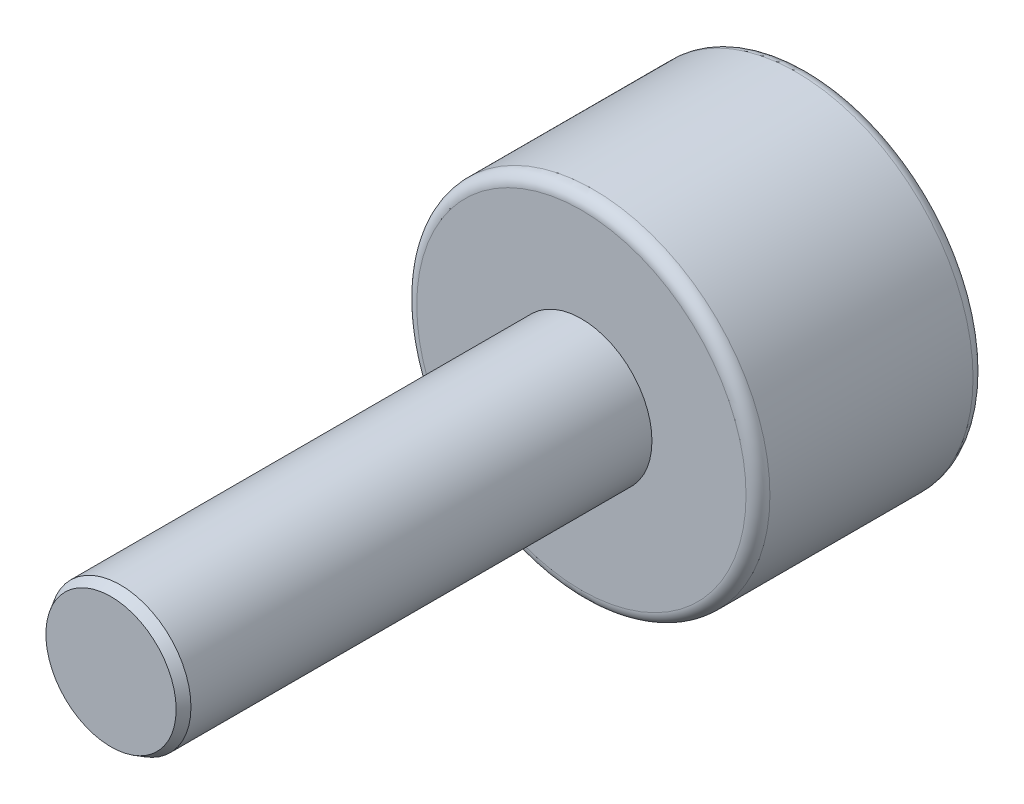
ISO-10303-21;
HEADER;
FILE_DESCRIPTION(('STEP AP214'),'2;1');
FILE_NAME('part.step','',(''),(''),'','','');
FILE_SCHEMA(('AUTOMOTIVE_DESIGN { 1 0 10303 214 1 1 1 1 }'));
ENDSEC;
DATA;
#1=APPLICATION_CONTEXT('core data for automotive mechanical design processes');
#2=APPLICATION_PROTOCOL_DEFINITION('international standard','automotive_design',2000,#1);
#3=PRODUCT_CONTEXT('',#1,'mechanical');
#4=PRODUCT('Part','Part','',(#3));
#5=PRODUCT_RELATED_PRODUCT_CATEGORY('part','',(#4));
#6=PRODUCT_DEFINITION_FORMATION('','',#4);
#7=PRODUCT_DEFINITION_CONTEXT('part definition',#1,'design');
#8=PRODUCT_DEFINITION('design','',#6,#7);
#9=PRODUCT_DEFINITION_SHAPE('','',#8);
#10=(LENGTH_UNIT() NAMED_UNIT(*) SI_UNIT(.MILLI.,.METRE.));
#11=(NAMED_UNIT(*) PLANE_ANGLE_UNIT() SI_UNIT($,.RADIAN.));
#12=(NAMED_UNIT(*) SI_UNIT($,.STERADIAN.) SOLID_ANGLE_UNIT());
#13=UNCERTAINTY_MEASURE_WITH_UNIT(LENGTH_MEASURE(1.E-05),#10,'distance_accuracy_value','');
#14=(GEOMETRIC_REPRESENTATION_CONTEXT(3) GLOBAL_UNCERTAINTY_ASSIGNED_CONTEXT((#13)) GLOBAL_UNIT_ASSIGNED_CONTEXT((#10,
#11,#12)) REPRESENTATION_CONTEXT('',''));
#15=CARTESIAN_POINT('',(0.,0.,0.));
#16=DIRECTION('',(0.,0.,1.));
#17=DIRECTION('',(1.,0.,0.));
#18=AXIS2_PLACEMENT_3D('',#15,#16,#17);
#19=CARTESIAN_POINT('',(3.50000000000001,0.,4.826));
#20=DIRECTION('',(0.,0.,1.));
#21=DIRECTION('',(1.,0.,0.));
#22=AXIS2_PLACEMENT_3D('',#19,#20,#21);
#23=PLANE('',#22);
#24=CARTESIAN_POINT('',(0.,0.,4.826));
#25=DIRECTION('',(0.,0.,1.));
#26=DIRECTION('',(1.,0.,0.));
#27=AXIS2_PLACEMENT_3D('',#24,#25,#26);
#28=CIRCLE('',#27,3.5);
#29=CARTESIAN_POINT('',(3.50000000000001,0.,4.826));
#30=VERTEX_POINT('',#29);
#31=EDGE_CURVE('E136',#30,#30,#28,.T.);
#32=ORIENTED_EDGE('',*,*,#31,.T.);
#33=EDGE_LOOP('',(#32));
#34=FACE_BOUND('',#33,.T.);
#35=CARTESIAN_POINT('',(0.,0.,4.826));
#36=DIRECTION('',(0.,0.,1.));
#37=DIRECTION('',(1.,0.,0.));
#38=AXIS2_PLACEMENT_3D('',#35,#36,#37);
#39=CIRCLE('',#38,1.5);
#40=CARTESIAN_POINT('',(1.5,0.,4.826));
#41=VERTEX_POINT('',#40);
#42=EDGE_CURVE('E123',#41,#41,#39,.T.);
#43=ORIENTED_EDGE('',*,*,#42,.F.);
#44=EDGE_LOOP('',(#43));
#45=FACE_BOUND('',#44,.T.);
#46=ADVANCED_FACE('F33',(#34,#45),#23,.T.);
#47=CARTESIAN_POINT('',(0.,0.,0.));
#48=DIRECTION('',(0.,0.,-1.));
#49=DIRECTION('',(-1.,0.,0.));
#50=AXIS2_PLACEMENT_3D('',#47,#48,#49);
#51=PLANE('',#50);
#52=DIRECTION('',(0.866025403784439,0.5,0.));
#53=VECTOR('',#52,1.);
#54=CARTESIAN_POINT('',(-2.20836477965032,1.275,0.));
#55=LINE('',#54,#53);
#56=CARTESIAN_POINT('',(-2.20836477965032,1.275,0.));
#57=VERTEX_POINT('',#56);
#58=CARTESIAN_POINT('',(0.,2.55,0.));
#59=VERTEX_POINT('',#58);
#60=EDGE_CURVE('E48',#57,#59,#55,.T.);
#61=ORIENTED_EDGE('',*,*,#60,.F.);
#62=DIRECTION('',(0.,1.,0.));
#63=VECTOR('',#62,1.);
#64=CARTESIAN_POINT('',(-2.20836477965032,-1.275,0.));
#65=LINE('',#64,#63);
#66=CARTESIAN_POINT('',(-2.20836477965032,-1.275,0.));
#67=VERTEX_POINT('',#66);
#68=EDGE_CURVE('E132',#67,#57,#65,.T.);
#69=ORIENTED_EDGE('',*,*,#68,.F.);
#70=DIRECTION('',(-0.866025403784439,0.5,0.));
#71=VECTOR('',#70,1.);
#72=CARTESIAN_POINT('',(0.,-2.55,0.));
#73=LINE('',#72,#71);
#74=CARTESIAN_POINT('',(0.,-2.55,0.));
#75=VERTEX_POINT('',#74);
#76=EDGE_CURVE('E130',#75,#67,#73,.T.);
#77=ORIENTED_EDGE('',*,*,#76,.F.);
#78=DIRECTION('',(-0.866025403784439,-0.5,0.));
#79=VECTOR('',#78,1.);
#80=CARTESIAN_POINT('',(2.20836477965032,-1.275,0.));
#81=LINE('',#80,#79);
#82=CARTESIAN_POINT('',(2.20836477965032,-1.275,0.));
#83=VERTEX_POINT('',#82);
#84=EDGE_CURVE('E96',#83,#75,#81,.T.);
#85=ORIENTED_EDGE('',*,*,#84,.F.);
#86=DIRECTION('',(0.,-1.,0.));
#87=VECTOR('',#86,1.);
#88=CARTESIAN_POINT('',(2.20836477965032,1.275,0.));
#89=LINE('',#88,#87);
#90=CARTESIAN_POINT('',(2.20836477965032,1.275,0.));
#91=VERTEX_POINT('',#90);
#92=EDGE_CURVE('E126',#91,#83,#89,.T.);
#93=ORIENTED_EDGE('',*,*,#92,.F.);
#94=DIRECTION('',(0.866025403784439,-0.5,0.));
#95=VECTOR('',#94,1.);
#96=CARTESIAN_POINT('',(0.,2.55,0.));
#97=LINE('',#96,#95);
#98=EDGE_CURVE('E122',#59,#91,#97,.T.);
#99=ORIENTED_EDGE('',*,*,#98,.F.);
#100=EDGE_LOOP('',(#61,#69,#77,#85,#93,#99));
#101=FACE_BOUND('',#100,.T.);
#102=CARTESIAN_POINT('',(0.,0.,0.));
#103=DIRECTION('',(0.,0.,1.));
#104=DIRECTION('',(1.,0.,0.));
#105=AXIS2_PLACEMENT_3D('',#102,#103,#104);
#106=CIRCLE('',#105,3.5);
#107=CARTESIAN_POINT('',(3.50000000000001,0.,0.));
#108=VERTEX_POINT('',#107);
#109=EDGE_CURVE('E150',#108,#108,#106,.T.);
#110=ORIENTED_EDGE('',*,*,#109,.F.);
#111=EDGE_LOOP('',(#110));
#112=FACE_BOUND('',#111,.T.);
#113=ADVANCED_FACE('F166',(#101,#112),#51,.T.);
#114=CARTESIAN_POINT('',(0.,0.,0.253999999999987));
#115=DIRECTION('',(0.,0.,1.));
#116=DIRECTION('',(1.,0.,0.));
#117=AXIS2_PLACEMENT_3D('',#114,#115,#116);
#118=TOROIDAL_SURFACE('',#117,3.5,0.254000000000001);
#119=ORIENTED_EDGE('',*,*,#109,.T.);
#120=EDGE_LOOP('',(#119));
#121=FACE_BOUND('',#120,.T.);
#122=CARTESIAN_POINT('',(0.,0.,0.253999999999987));
#123=DIRECTION('',(0.,0.,1.));
#124=DIRECTION('',(1.,0.,0.));
#125=AXIS2_PLACEMENT_3D('',#122,#123,#124);
#126=CIRCLE('',#125,3.754);
#127=CARTESIAN_POINT('',(3.75400000000002,0.,0.253999999999987));
#128=VERTEX_POINT('',#127);
#129=EDGE_CURVE('E147',#128,#128,#126,.T.);
#130=ORIENTED_EDGE('',*,*,#129,.F.);
#131=EDGE_LOOP('',(#130));
#132=FACE_BOUND('',#131,.T.);
#133=ADVANCED_FACE('F172',(#121,#132),#118,.T.);
#134=CARTESIAN_POINT('',(0.,0.,0.));
#135=DIRECTION('',(0.,0.,1.));
#136=DIRECTION('',(1.,0.,0.));
#137=AXIS2_PLACEMENT_3D('',#134,#135,#136);
#138=CYLINDRICAL_SURFACE('',#137,3.754);
#139=ORIENTED_EDGE('',*,*,#129,.T.);
#140=EDGE_LOOP('',(#139));
#141=FACE_BOUND('',#140,.T.);
#142=CARTESIAN_POINT('',(0.,0.,4.572));
#143=DIRECTION('',(0.,0.,1.));
#144=DIRECTION('',(1.,0.,0.));
#145=AXIS2_PLACEMENT_3D('',#142,#143,#144);
#146=CIRCLE('',#145,3.754);
#147=CARTESIAN_POINT('',(3.75400000000002,0.,4.572));
#148=VERTEX_POINT('',#147);
#149=EDGE_CURVE('E144',#148,#148,#146,.T.);
#150=ORIENTED_EDGE('',*,*,#149,.F.);
#151=EDGE_LOOP('',(#150));
#152=FACE_BOUND('',#151,.T.);
#153=ADVANCED_FACE('F182',(#141,#152),#138,.T.);
#154=CARTESIAN_POINT('',(0.,0.,4.572));
#155=DIRECTION('',(0.,0.,1.));
#156=DIRECTION('',(1.,0.,0.));
#157=AXIS2_PLACEMENT_3D('',#154,#155,#156);
#158=TOROIDAL_SURFACE('',#157,3.5,0.254000000000001);
#159=ORIENTED_EDGE('',*,*,#149,.T.);
#160=EDGE_LOOP('',(#159));
#161=FACE_BOUND('',#160,.T.);
#162=ORIENTED_EDGE('',*,*,#31,.F.);
#163=EDGE_LOOP('',(#162));
#164=FACE_BOUND('',#163,.T.);
#165=ADVANCED_FACE('F179',(#161,#164),#158,.T.);
#166=CARTESIAN_POINT('',(-2.2083647796503,1.275,2.54000000000002));
#167=DIRECTION('',(-0.5,0.866025403784439,0.));
#168=DIRECTION('',(-0.866025403784439,-0.5,0.));
#169=AXIS2_PLACEMENT_3D('',#166,#167,#168);
#170=PLANE('',#169);
#171=ORIENTED_EDGE('',*,*,#60,.T.);
#172=DIRECTION('',(0.,0.,-1.));
#173=VECTOR('',#172,1.);
#174=CARTESIAN_POINT('',(0.,2.55,2.54));
#175=LINE('',#174,#173);
#176=CARTESIAN_POINT('',(0.,2.55,2.54));
#177=VERTEX_POINT('',#176);
#178=EDGE_CURVE('E78',#177,#59,#175,.T.);
#179=ORIENTED_EDGE('',*,*,#178,.F.);
#180=DIRECTION('',(0.866025403784439,0.5,0.));
#181=VECTOR('',#180,1.);
#182=CARTESIAN_POINT('',(-2.2083647796503,1.275,2.54000000000002));
#183=LINE('',#182,#181);
#184=CARTESIAN_POINT('',(-2.2083647796503,1.275,2.54000000000002));
#185=VERTEX_POINT('',#184);
#186=EDGE_CURVE('E134',#185,#177,#183,.T.);
#187=ORIENTED_EDGE('',*,*,#186,.F.);
#188=DIRECTION('',(0.,0.,-1.));
#189=VECTOR('',#188,1.);
#190=CARTESIAN_POINT('',(-2.2083647796503,1.275,2.54000000000002));
#191=LINE('',#190,#189);
#192=EDGE_CURVE('E56',#185,#57,#191,.T.);
#193=ORIENTED_EDGE('',*,*,#192,.T.);
#194=EDGE_LOOP('',(#171,#179,#187,#193));
#195=FACE_BOUND('',#194,.T.);
#196=ADVANCED_FACE('F177',(#195),#170,.F.);
#197=CARTESIAN_POINT('',(-2.2083647796503,-1.275,2.54000000000002));
#198=DIRECTION('',(-1.,0.,0.));
#199=DIRECTION('',(0.,0.,1.));
#200=AXIS2_PLACEMENT_3D('',#197,#198,#199);
#201=PLANE('',#200);
#202=ORIENTED_EDGE('',*,*,#68,.T.);
#203=ORIENTED_EDGE('',*,*,#192,.F.);
#204=DIRECTION('',(0.,1.,0.));
#205=VECTOR('',#204,1.);
#206=CARTESIAN_POINT('',(-2.2083647796503,-1.275,2.54000000000002));
#207=LINE('',#206,#205);
#208=CARTESIAN_POINT('',(-2.2083647796503,-1.275,2.54000000000002));
#209=VERTEX_POINT('',#208);
#210=EDGE_CURVE('E108',#209,#185,#207,.T.);
#211=ORIENTED_EDGE('',*,*,#210,.F.);
#212=DIRECTION('',(0.,0.,-1.));
#213=VECTOR('',#212,1.);
#214=CARTESIAN_POINT('',(-2.2083647796503,-1.275,2.54000000000002));
#215=LINE('',#214,#213);
#216=EDGE_CURVE('E100',#209,#67,#215,.T.);
#217=ORIENTED_EDGE('',*,*,#216,.T.);
#218=EDGE_LOOP('',(#202,#203,#211,#217));
#219=FACE_BOUND('',#218,.T.);
#220=ADVANCED_FACE('F215',(#219),#201,.F.);
#221=CARTESIAN_POINT('',(0.,-2.55,2.54));
#222=DIRECTION('',(-0.5,-0.866025403784439,0.));
#223=DIRECTION('',(0.866025403784439,-0.5,0.));
#224=AXIS2_PLACEMENT_3D('',#221,#222,#223);
#225=PLANE('',#224);
#226=ORIENTED_EDGE('',*,*,#76,.T.);
#227=ORIENTED_EDGE('',*,*,#216,.F.);
#228=DIRECTION('',(-0.866025403784439,0.5,0.));
#229=VECTOR('',#228,1.);
#230=CARTESIAN_POINT('',(0.,-2.55,2.54));
#231=LINE('',#230,#229);
#232=CARTESIAN_POINT('',(0.,-2.55,2.54));
#233=VERTEX_POINT('',#232);
#234=EDGE_CURVE('E104',#233,#209,#231,.T.);
#235=ORIENTED_EDGE('',*,*,#234,.F.);
#236=DIRECTION('',(0.,0.,-1.));
#237=VECTOR('',#236,1.);
#238=CARTESIAN_POINT('',(0.,-2.55,2.54));
#239=LINE('',#238,#237);
#240=EDGE_CURVE('E89',#233,#75,#239,.T.);
#241=ORIENTED_EDGE('',*,*,#240,.T.);
#242=EDGE_LOOP('',(#226,#227,#235,#241));
#243=FACE_BOUND('',#242,.T.);
#244=ADVANCED_FACE('F105',(#243),#225,.F.);
#245=CARTESIAN_POINT('',(2.20836477965034,-1.275,2.53999999999998));
#246=DIRECTION('',(0.5,-0.866025403784439,0.));
#247=DIRECTION('',(0.866025403784439,0.5,0.));
#248=AXIS2_PLACEMENT_3D('',#245,#246,#247);
#249=PLANE('',#248);
#250=ORIENTED_EDGE('',*,*,#84,.T.);
#251=ORIENTED_EDGE('',*,*,#240,.F.);
#252=DIRECTION('',(-0.866025403784439,-0.5,0.));
#253=VECTOR('',#252,1.);
#254=CARTESIAN_POINT('',(2.20836477965034,-1.275,2.53999999999998));
#255=LINE('',#254,#253);
#256=CARTESIAN_POINT('',(2.20836477965034,-1.275,2.53999999999998));
#257=VERTEX_POINT('',#256);
#258=EDGE_CURVE('E93',#257,#233,#255,.T.);
#259=ORIENTED_EDGE('',*,*,#258,.F.);
#260=DIRECTION('',(0.,0.,-1.));
#261=VECTOR('',#260,1.);
#262=CARTESIAN_POINT('',(2.20836477965034,-1.275,2.53999999999998));
#263=LINE('',#262,#261);
#264=EDGE_CURVE('E101',#257,#83,#263,.T.);
#265=ORIENTED_EDGE('',*,*,#264,.T.);
#266=EDGE_LOOP('',(#250,#251,#259,#265));
#267=FACE_BOUND('',#266,.T.);
#268=ADVANCED_FACE('F91',(#267),#249,.F.);
#269=CARTESIAN_POINT('',(2.20836477965034,1.275,2.53999999999998));
#270=DIRECTION('',(1.,0.,0.));
#271=DIRECTION('',(0.,0.,-1.));
#272=AXIS2_PLACEMENT_3D('',#269,#270,#271);
#273=PLANE('',#272);
#274=ORIENTED_EDGE('',*,*,#92,.T.);
#275=ORIENTED_EDGE('',*,*,#264,.F.);
#276=DIRECTION('',(0.,-1.,0.));
#277=VECTOR('',#276,1.);
#278=CARTESIAN_POINT('',(2.20836477965034,1.275,2.53999999999998));
#279=LINE('',#278,#277);
#280=CARTESIAN_POINT('',(2.20836477965034,1.275,2.53999999999998));
#281=VERTEX_POINT('',#280);
#282=EDGE_CURVE('E114',#281,#257,#279,.T.);
#283=ORIENTED_EDGE('',*,*,#282,.F.);
#284=DIRECTION('',(0.,0.,-1.));
#285=VECTOR('',#284,1.);
#286=CARTESIAN_POINT('',(2.20836477965034,1.275,2.53999999999998));
#287=LINE('',#286,#285);
#288=EDGE_CURVE('E139',#281,#91,#287,.T.);
#289=ORIENTED_EDGE('',*,*,#288,.T.);
#290=EDGE_LOOP('',(#274,#275,#283,#289));
#291=FACE_BOUND('',#290,.T.);
#292=ADVANCED_FACE('F233',(#291),#273,.F.);
#293=CARTESIAN_POINT('',(0.,2.55,2.54));
#294=DIRECTION('',(0.5,0.866025403784439,0.));
#295=DIRECTION('',(-0.866025403784439,0.5,0.));
#296=AXIS2_PLACEMENT_3D('',#293,#294,#295);
#297=PLANE('',#296);
#298=ORIENTED_EDGE('',*,*,#98,.T.);
#299=ORIENTED_EDGE('',*,*,#288,.F.);
#300=DIRECTION('',(0.866025403784439,-0.5,0.));
#301=VECTOR('',#300,1.);
#302=CARTESIAN_POINT('',(0.,2.55,2.54));
#303=LINE('',#302,#301);
#304=EDGE_CURVE('E116',#177,#281,#303,.T.);
#305=ORIENTED_EDGE('',*,*,#304,.F.);
#306=ORIENTED_EDGE('',*,*,#178,.T.);
#307=EDGE_LOOP('',(#298,#299,#305,#306));
#308=FACE_BOUND('',#307,.T.);
#309=ADVANCED_FACE('F240',(#308),#297,.F.);
#310=CARTESIAN_POINT('',(0.,2.55,2.54));
#311=DIRECTION('',(0.,0.,-1.));
#312=DIRECTION('',(-1.,0.,0.));
#313=AXIS2_PLACEMENT_3D('',#310,#311,#312);
#314=PLANE('',#313);
#315=ORIENTED_EDGE('',*,*,#186,.T.);
#316=ORIENTED_EDGE('',*,*,#304,.T.);
#317=ORIENTED_EDGE('',*,*,#282,.T.);
#318=ORIENTED_EDGE('',*,*,#258,.T.);
#319=ORIENTED_EDGE('',*,*,#234,.T.);
#320=ORIENTED_EDGE('',*,*,#210,.T.);
#321=EDGE_LOOP('',(#315,#316,#317,#318,#319,#320));
#322=FACE_BOUND('',#321,.T.);
#323=ADVANCED_FACE('F111',(#322),#314,.T.);
#324=CARTESIAN_POINT('',(0.,0.,14.826));
#325=DIRECTION('',(0.,0.,-1.));
#326=DIRECTION('',(-1.,0.,0.));
#327=AXIS2_PLACEMENT_3D('',#324,#325,#326);
#328=CYLINDRICAL_SURFACE('',#327,1.5);
#329=CARTESIAN_POINT('',(0.,0.,14.626));
#330=DIRECTION('',(0.,0.,1.));
#331=DIRECTION('',(1.,0.,0.));
#332=AXIS2_PLACEMENT_3D('',#329,#330,#331);
#333=CIRCLE('',#332,1.5);
#334=CARTESIAN_POINT('',(1.5,0.,14.626));
#335=VERTEX_POINT('',#334);
#336=EDGE_CURVE('E11',#335,#335,#333,.F.);
#337=ORIENTED_EDGE('',*,*,#336,.T.);
#338=EDGE_LOOP('',(#337));
#339=FACE_BOUND('',#338,.T.);
#340=ORIENTED_EDGE('',*,*,#42,.T.);
#341=EDGE_LOOP('',(#340));
#342=FACE_BOUND('',#341,.T.);
#343=ADVANCED_FACE('F162',(#339,#342),#328,.T.);
#344=CARTESIAN_POINT('',(0.,0.,14.826));
#345=DIRECTION('',(0.,0.,1.));
#346=DIRECTION('',(1.,0.,0.));
#347=AXIS2_PLACEMENT_3D('',#344,#345,#346);
#348=PLANE('',#347);
#349=CARTESIAN_POINT('',(0.,0.,14.826));
#350=DIRECTION('',(0.,0.,1.));
#351=DIRECTION('',(1.,0.,0.));
#352=AXIS2_PLACEMENT_3D('',#349,#350,#351);
#353=CIRCLE('',#352,1.38452994616208);
#354=CARTESIAN_POINT('',(1.38452994616208,0.,14.826));
#355=VERTEX_POINT('',#354);
#356=EDGE_CURVE('E41',#355,#355,#353,.T.);
#357=ORIENTED_EDGE('',*,*,#356,.T.);
#358=EDGE_LOOP('',(#357));
#359=FACE_BOUND('',#358,.T.);
#360=ADVANCED_FACE('F155',(#359),#348,.T.);
#361=CARTESIAN_POINT('',(0.,0.,14.826));
#362=DIRECTION('',(0.,0.,-1.));
#363=DIRECTION('',(-1.,0.,0.));
#364=AXIS2_PLACEMENT_3D('',#361,#362,#363);
#365=CONICAL_SURFACE('',#364,1.38452994616208,0.523598775598289);
#366=ORIENTED_EDGE('',*,*,#336,.F.);
#367=EDGE_LOOP('',(#366));
#368=FACE_BOUND('',#367,.T.);
#369=ORIENTED_EDGE('',*,*,#356,.F.);
#370=EDGE_LOOP('',(#369));
#371=FACE_BOUND('',#370,.T.);
#372=ADVANCED_FACE('F35',(#368,#371),#365,.T.);
#373=CLOSED_SHELL('',(#46,#113,#133,#153,#165,#196,#220,#244,#268,#292,#309,#323,#343,#360,#372));
#374=MANIFOLD_SOLID_BREP('B2',#373);
#375=ADVANCED_BREP_SHAPE_REPRESENTATION('',(#18,#374),#14);
#376=SHAPE_DEFINITION_REPRESENTATION(#9,#375);
ENDSEC;
END-ISO-10303-21;
